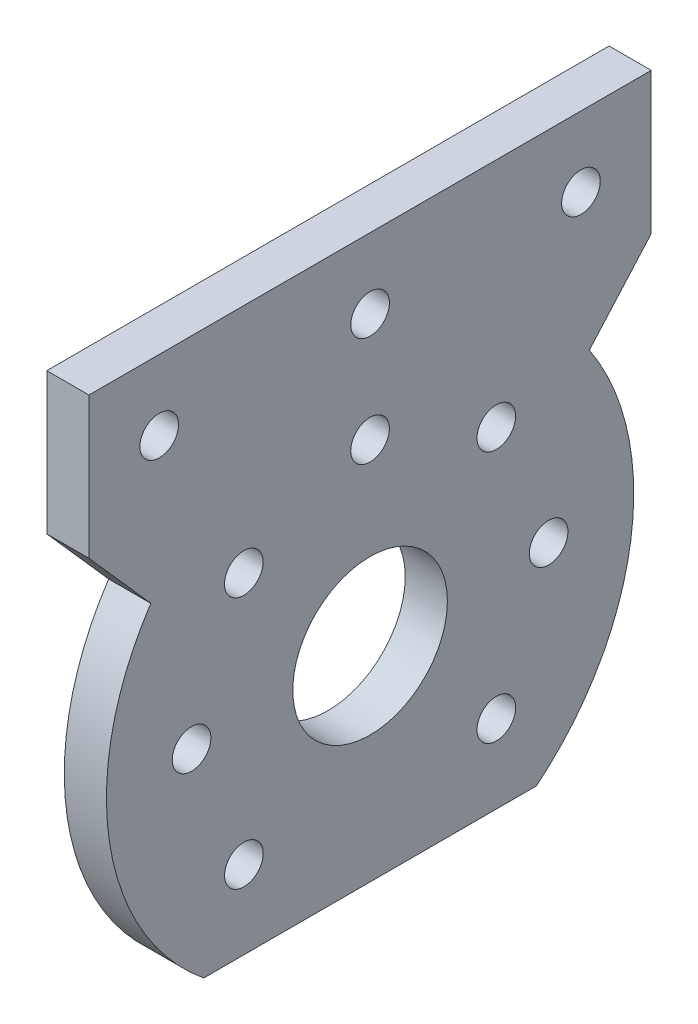
ISO-10303-21;
HEADER;
FILE_DESCRIPTION(('STEP AP214'),'2;1');
FILE_NAME('part.step','',(''),(''),'','','');
FILE_SCHEMA(('AUTOMOTIVE_DESIGN { 1 0 10303 214 1 1 1 1 }'));
ENDSEC;
DATA;
#1=APPLICATION_CONTEXT('core data for automotive mechanical design processes');
#2=APPLICATION_PROTOCOL_DEFINITION('international standard','automotive_design',2000,#1);
#3=PRODUCT_CONTEXT('',#1,'mechanical');
#4=PRODUCT('Part','Part','',(#3));
#5=PRODUCT_RELATED_PRODUCT_CATEGORY('part','',(#4));
#6=PRODUCT_DEFINITION_FORMATION('','',#4);
#7=PRODUCT_DEFINITION_CONTEXT('part definition',#1,'design');
#8=PRODUCT_DEFINITION('design','',#6,#7);
#9=PRODUCT_DEFINITION_SHAPE('','',#8);
#10=(LENGTH_UNIT() NAMED_UNIT(*) SI_UNIT(.MILLI.,.METRE.));
#11=(NAMED_UNIT(*) PLANE_ANGLE_UNIT() SI_UNIT($,.RADIAN.));
#12=(NAMED_UNIT(*) SI_UNIT($,.STERADIAN.) SOLID_ANGLE_UNIT());
#13=UNCERTAINTY_MEASURE_WITH_UNIT(LENGTH_MEASURE(1.E-05),#10,'distance_accuracy_value','');
#14=(GEOMETRIC_REPRESENTATION_CONTEXT(3) GLOBAL_UNCERTAINTY_ASSIGNED_CONTEXT((#13)) GLOBAL_UNIT_ASSIGNED_CONTEXT((#10,
#11,#12)) REPRESENTATION_CONTEXT('',''));
#15=CARTESIAN_POINT('',(0.,0.,0.));
#16=DIRECTION('',(0.,0.,1.));
#17=DIRECTION('',(1.,0.,0.));
#18=AXIS2_PLACEMENT_3D('',#15,#16,#17);
#19=CARTESIAN_POINT('',(6.,0.,0.));
#20=DIRECTION('',(1.,0.,0.));
#21=DIRECTION('',(0.,0.,-1.));
#22=AXIS2_PLACEMENT_3D('',#19,#20,#21);
#23=PLANE('',#22);
#24=CARTESIAN_POINT('',(6.,-25.9195874201447,13.6506110509053));
#25=DIRECTION('',(-1.,0.,0.));
#26=DIRECTION('',(0.,0.,1.));
#27=AXIS2_PLACEMENT_3D('',#24,#25,#26);
#28=CIRCLE('',#27,2.75000000000003);
#29=CARTESIAN_POINT('',(6.,-25.9195874201447,16.4006110509053));
#30=VERTEX_POINT('',#29);
#31=EDGE_CURVE('E166',#30,#30,#28,.T.);
#32=ORIENTED_EDGE('',*,*,#31,.T.);
#33=EDGE_LOOP('',(#32));
#34=FACE_BOUND('',#33,.T.);
#35=CARTESIAN_POINT('',(6.,-43.8778328617474,6.20565310887963));
#36=DIRECTION('',(-1.,0.,0.));
#37=DIRECTION('',(0.,0.,1.));
#38=AXIS2_PLACEMENT_3D('',#35,#36,#37);
#39=CIRCLE('',#38,2.75000000000003);
#40=CARTESIAN_POINT('',(6.,-43.8778328617474,8.95565310887966));
#41=VERTEX_POINT('',#40);
#42=EDGE_CURVE('E196',#41,#41,#39,.T.);
#43=ORIENTED_EDGE('',*,*,#42,.T.);
#44=EDGE_LOOP('',(#43));
#45=FACE_BOUND('',#44,.T.);
#46=CARTESIAN_POINT('',(6.,-43.8668918032364,-29.7153697091477));
#47=DIRECTION('',(-1.,0.,0.));
#48=DIRECTION('',(0.,0.,1.));
#49=AXIS2_PLACEMENT_3D('',#46,#47,#48);
#50=CIRCLE('',#49,2.75000000000003);
#51=CARTESIAN_POINT('',(6.,-43.8668918032364,-26.9653697091477));
#52=VERTEX_POINT('',#51);
#53=EDGE_CURVE('E194',#52,#52,#50,.T.);
#54=ORIENTED_EDGE('',*,*,#53,.T.);
#55=EDGE_LOOP('',(#54));
#56=FACE_BOUND('',#55,.T.);
#57=CARTESIAN_POINT('',(6.,-25.9041144268118,-37.1493865926623));
#58=DIRECTION('',(-1.,0.,0.));
#59=DIRECTION('',(0.,0.,1.));
#60=AXIS2_PLACEMENT_3D('',#57,#58,#59);
#61=CIRCLE('',#60,2.75000000000003);
#62=CARTESIAN_POINT('',(6.,-25.9041144268118,-34.3993865926623));
#63=VERTEX_POINT('',#62);
#64=EDGE_CURVE('E188',#63,#63,#61,.T.);
#65=ORIENTED_EDGE('',*,*,#64,.T.);
#66=EDGE_LOOP('',(#65));
#67=FACE_BOUND('',#66,.T.);
#68=CARTESIAN_POINT('',(6.,-7.94586898520909,-29.7044286506367));
#69=DIRECTION('',(-1.,0.,0.));
#70=DIRECTION('',(0.,0.,1.));
#71=AXIS2_PLACEMENT_3D('',#68,#69,#70);
#72=CIRCLE('',#71,2.75000000000003);
#73=CARTESIAN_POINT('',(6.,-7.94586898520909,-26.9544286506366));
#74=VERTEX_POINT('',#73);
#75=EDGE_CURVE('E176',#74,#74,#72,.T.);
#76=ORIENTED_EDGE('',*,*,#75,.T.);
#77=EDGE_LOOP('',(#76));
#78=FACE_BOUND('',#77,.T.);
#79=CARTESIAN_POINT('',(6.,-0.51185210169441,-11.7416512742121));
#80=DIRECTION('',(-1.,0.,0.));
#81=DIRECTION('',(0.,0.,1.));
#82=AXIS2_PLACEMENT_3D('',#79,#80,#81);
#83=CIRCLE('',#82,2.75000000000003);
#84=CARTESIAN_POINT('',(6.,-0.51185210169441,-8.99165127421204));
#85=VERTEX_POINT('',#84);
#86=EDGE_CURVE('E174',#85,#85,#83,.T.);
#87=ORIENTED_EDGE('',*,*,#86,.T.);
#88=EDGE_LOOP('',(#87));
#89=FACE_BOUND('',#88,.T.);
#90=CARTESIAN_POINT('',(6.,-7.9568100437201,6.21659416739064));
#91=DIRECTION('',(-1.,0.,0.));
#92=DIRECTION('',(0.,0.,1.));
#93=AXIS2_PLACEMENT_3D('',#90,#91,#92);
#94=CIRCLE('',#93,2.75000000000003);
#95=CARTESIAN_POINT('',(6.,-7.9568100437201,8.96659416739067));
#96=VERTEX_POINT('',#95);
#97=EDGE_CURVE('E206',#96,#96,#94,.T.);
#98=ORIENTED_EDGE('',*,*,#97,.T.);
#99=EDGE_LOOP('',(#98));
#100=FACE_BOUND('',#99,.T.);
#101=CARTESIAN_POINT('',(6.,-25.9118509234781,-11.7493877708786));
#102=DIRECTION('',(1.,0.,0.));
#103=DIRECTION('',(0.,0.,-1.));
#104=AXIS2_PLACEMENT_3D('',#101,#102,#103);
#105=CIRCLE('',#104,11.);
#106=CARTESIAN_POINT('',(6.,-25.9118509234781,-22.7493877708786));
#107=VERTEX_POINT('',#106);
#108=EDGE_CURVE('E132',#107,#107,#105,.T.);
#109=ORIENTED_EDGE('',*,*,#108,.F.);
#110=EDGE_LOOP('',(#109));
#111=FACE_BOUND('',#110,.T.);
#112=CARTESIAN_POINT('',(6.,14.9878934624697,-11.7493877708786));
#113=DIRECTION('',(1.,0.,0.));
#114=DIRECTION('',(0.,0.,-1.));
#115=AXIS2_PLACEMENT_3D('',#112,#113,#114);
#116=CIRCLE('',#115,2.75);
#117=CARTESIAN_POINT('',(6.,14.9878934624697,-14.4993877708786));
#118=VERTEX_POINT('',#117);
#119=EDGE_CURVE('E214',#118,#118,#116,.T.);
#120=ORIENTED_EDGE('',*,*,#119,.F.);
#121=EDGE_LOOP('',(#120));
#122=FACE_BOUND('',#121,.T.);
#123=CARTESIAN_POINT('',(6.,14.9878934624697,-41.7493877708786));
#124=DIRECTION('',(1.,0.,0.));
#125=DIRECTION('',(0.,0.,-1.));
#126=AXIS2_PLACEMENT_3D('',#123,#124,#125);
#127=CIRCLE('',#126,2.75);
#128=CARTESIAN_POINT('',(6.,14.9878934624697,-44.4993877708786));
#129=VERTEX_POINT('',#128);
#130=EDGE_CURVE('E228',#129,#129,#127,.T.);
#131=ORIENTED_EDGE('',*,*,#130,.F.);
#132=EDGE_LOOP('',(#131));
#133=FACE_BOUND('',#132,.T.);
#134=CARTESIAN_POINT('',(6.,14.9878934624697,18.2506122291214));
#135=DIRECTION('',(1.,0.,0.));
#136=DIRECTION('',(0.,0.,-1.));
#137=AXIS2_PLACEMENT_3D('',#134,#135,#136);
#138=CIRCLE('',#137,2.75);
#139=CARTESIAN_POINT('',(6.,14.9878934624697,15.5006122291214));
#140=VERTEX_POINT('',#139);
#141=EDGE_CURVE('E212',#140,#140,#138,.T.);
#142=ORIENTED_EDGE('',*,*,#141,.F.);
#143=EDGE_LOOP('',(#142));
#144=FACE_BOUND('',#143,.T.);
#145=DIRECTION('',(0.,-0.749175450531443,0.662371605913938));
#146=VECTOR('',#145,1.);
#147=CARTESIAN_POINT('',(6.,4.8701956870651,-51.7493877708786));
#148=LINE('',#147,#146);
#149=CARTESIAN_POINT('',(6.,4.8701956870651,-51.7493877708786));
#150=VERTEX_POINT('',#149);
#151=CARTESIAN_POINT('',(6.,-5.0878040938187,-42.945180022379));
#152=VERTEX_POINT('',#151);
#153=EDGE_CURVE('E236',#150,#152,#148,.T.);
#154=ORIENTED_EDGE('',*,*,#153,.F.);
#155=DIRECTION('',(0.,1.,0.));
#156=VECTOR('',#155,1.);
#157=CARTESIAN_POINT('',(6.,24.9878934624697,-51.7493877708786));
#158=LINE('',#157,#156);
#159=CARTESIAN_POINT('',(6.,24.9878934624697,-51.7493877708786));
#160=VERTEX_POINT('',#159);
#161=EDGE_CURVE('E154',#150,#160,#158,.T.);
#162=ORIENTED_EDGE('',*,*,#161,.T.);
#163=DIRECTION('',(0.,0.,1.));
#164=VECTOR('',#163,1.);
#165=CARTESIAN_POINT('',(6.,24.9878934624697,28.2506122291214));
#166=LINE('',#165,#164);
#167=CARTESIAN_POINT('',(6.,24.9878934624697,28.2506122291214));
#168=VERTEX_POINT('',#167);
#169=EDGE_CURVE('E137',#160,#168,#166,.T.);
#170=ORIENTED_EDGE('',*,*,#169,.T.);
#171=DIRECTION('',(0.,-1.,0.));
#172=VECTOR('',#171,1.);
#173=CARTESIAN_POINT('',(6.,24.9878934624697,28.2506122291214));
#174=LINE('',#173,#172);
#175=CARTESIAN_POINT('',(6.,4.8701956870651,28.2506122291214));
#176=VERTEX_POINT('',#175);
#177=EDGE_CURVE('E145',#168,#176,#174,.T.);
#178=ORIENTED_EDGE('',*,*,#177,.T.);
#179=DIRECTION('',(0.,0.749175450531444,0.662371605913938));
#180=VECTOR('',#179,1.);
#181=CARTESIAN_POINT('',(6.,-5.0878040938187,19.4464044806217));
#182=LINE('',#181,#180);
#183=CARTESIAN_POINT('',(6.,-5.0878040938187,19.4464044806217));
#184=VERTEX_POINT('',#183);
#185=EDGE_CURVE('E110',#184,#176,#182,.T.);
#186=ORIENTED_EDGE('',*,*,#185,.F.);
#187=CARTESIAN_POINT('',(6.,-25.9118509234781,-11.7493877708786));
#188=DIRECTION('',(-1.,0.,0.));
#189=DIRECTION('',(0.,0.,-1.));
#190=AXIS2_PLACEMENT_3D('',#187,#188,#189);
#191=CIRCLE('',#190,37.5075776418928);
#192=CARTESIAN_POINT('',(6.,-55.0121065375303,11.9147941029882));
#193=VERTEX_POINT('',#192);
#194=EDGE_CURVE('E237',#193,#184,#191,.T.);
#195=ORIENTED_EDGE('',*,*,#194,.F.);
#196=DIRECTION('',(0.,0.,-1.));
#197=VECTOR('',#196,1.);
#198=CARTESIAN_POINT('',(6.,-55.0121065375303,28.2506122291214));
#199=LINE('',#198,#197);
#200=CARTESIAN_POINT('',(6.,-55.0121065375303,-35.4135696447454));
#201=VERTEX_POINT('',#200);
#202=EDGE_CURVE('E234',#193,#201,#199,.T.);
#203=ORIENTED_EDGE('',*,*,#202,.T.);
#204=EDGE_CURVE('E239',#152,#201,#191,.T.);
#205=ORIENTED_EDGE('',*,*,#204,.F.);
#206=EDGE_LOOP('',(#154,#162,#170,#178,#186,#195,#203,#205));
#207=FACE_BOUND('',#206,.T.);
#208=ADVANCED_FACE('F39',(#34,#45,#56,#67,#78,#89,#100,#111,#122,#133,#144,#207),#23,.T.);
#209=CARTESIAN_POINT('',(0.,0.,0.));
#210=DIRECTION('',(1.,0.,0.));
#211=DIRECTION('',(0.,0.,-1.));
#212=AXIS2_PLACEMENT_3D('',#209,#210,#211);
#213=PLANE('',#212);
#214=CARTESIAN_POINT('',(0.,-25.9195874201447,13.6506110509053));
#215=DIRECTION('',(-1.,0.,0.));
#216=DIRECTION('',(0.,0.,1.));
#217=AXIS2_PLACEMENT_3D('',#214,#215,#216);
#218=CIRCLE('',#217,2.75000000000003);
#219=CARTESIAN_POINT('',(0.,-25.9195874201447,16.4006110509053));
#220=VERTEX_POINT('',#219);
#221=EDGE_CURVE('E203',#220,#220,#218,.T.);
#222=ORIENTED_EDGE('',*,*,#221,.F.);
#223=EDGE_LOOP('',(#222));
#224=FACE_BOUND('',#223,.T.);
#225=CARTESIAN_POINT('',(0.,-43.8778328617474,6.20565310887963));
#226=DIRECTION('',(-1.,0.,0.));
#227=DIRECTION('',(0.,0.,1.));
#228=AXIS2_PLACEMENT_3D('',#225,#226,#227);
#229=CIRCLE('',#228,2.75000000000003);
#230=CARTESIAN_POINT('',(0.,-43.8778328617474,8.95565310887966));
#231=VERTEX_POINT('',#230);
#232=EDGE_CURVE('E191',#231,#231,#229,.T.);
#233=ORIENTED_EDGE('',*,*,#232,.F.);
#234=EDGE_LOOP('',(#233));
#235=FACE_BOUND('',#234,.T.);
#236=CARTESIAN_POINT('',(0.,-43.8668918032364,-29.7153697091477));
#237=DIRECTION('',(-1.,0.,0.));
#238=DIRECTION('',(0.,0.,1.));
#239=AXIS2_PLACEMENT_3D('',#236,#237,#238);
#240=CIRCLE('',#239,2.75000000000003);
#241=CARTESIAN_POINT('',(0.,-43.8668918032364,-26.9653697091477));
#242=VERTEX_POINT('',#241);
#243=EDGE_CURVE('E189',#242,#242,#240,.T.);
#244=ORIENTED_EDGE('',*,*,#243,.F.);
#245=EDGE_LOOP('',(#244));
#246=FACE_BOUND('',#245,.T.);
#247=CARTESIAN_POINT('',(0.,-25.9041144268118,-37.1493865926623));
#248=DIRECTION('',(-1.,0.,0.));
#249=DIRECTION('',(0.,0.,1.));
#250=AXIS2_PLACEMENT_3D('',#247,#248,#249);
#251=CIRCLE('',#250,2.75000000000003);
#252=CARTESIAN_POINT('',(0.,-25.9041144268118,-34.3993865926623));
#253=VERTEX_POINT('',#252);
#254=EDGE_CURVE('E181',#253,#253,#251,.T.);
#255=ORIENTED_EDGE('',*,*,#254,.F.);
#256=EDGE_LOOP('',(#255));
#257=FACE_BOUND('',#256,.T.);
#258=CARTESIAN_POINT('',(0.,-7.94586898520909,-29.7044286506367));
#259=DIRECTION('',(-1.,0.,0.));
#260=DIRECTION('',(0.,0.,1.));
#261=AXIS2_PLACEMENT_3D('',#258,#259,#260);
#262=CIRCLE('',#261,2.75000000000003);
#263=CARTESIAN_POINT('',(0.,-7.94586898520909,-26.9544286506366));
#264=VERTEX_POINT('',#263);
#265=EDGE_CURVE('E179',#264,#264,#262,.T.);
#266=ORIENTED_EDGE('',*,*,#265,.F.);
#267=EDGE_LOOP('',(#266));
#268=FACE_BOUND('',#267,.T.);
#269=CARTESIAN_POINT('',(0.,-0.51185210169441,-11.7416512742121));
#270=DIRECTION('',(-1.,0.,0.));
#271=DIRECTION('',(0.,0.,1.));
#272=AXIS2_PLACEMENT_3D('',#269,#270,#271);
#273=CIRCLE('',#272,2.75000000000003);
#274=CARTESIAN_POINT('',(0.,-0.51185210169441,-8.99165127421204));
#275=VERTEX_POINT('',#274);
#276=EDGE_CURVE('E168',#275,#275,#273,.T.);
#277=ORIENTED_EDGE('',*,*,#276,.F.);
#278=EDGE_LOOP('',(#277));
#279=FACE_BOUND('',#278,.T.);
#280=CARTESIAN_POINT('',(0.,-7.9568100437201,6.21659416739064));
#281=DIRECTION('',(-1.,0.,0.));
#282=DIRECTION('',(0.,0.,1.));
#283=AXIS2_PLACEMENT_3D('',#280,#281,#282);
#284=CIRCLE('',#283,2.75000000000003);
#285=CARTESIAN_POINT('',(0.,-7.9568100437201,8.96659416739067));
#286=VERTEX_POINT('',#285);
#287=EDGE_CURVE('E171',#286,#286,#284,.T.);
#288=ORIENTED_EDGE('',*,*,#287,.F.);
#289=EDGE_LOOP('',(#288));
#290=FACE_BOUND('',#289,.T.);
#291=CARTESIAN_POINT('',(0.,-25.9118509234781,-11.7493877708786));
#292=DIRECTION('',(1.,0.,0.));
#293=DIRECTION('',(0.,0.,-1.));
#294=AXIS2_PLACEMENT_3D('',#291,#292,#293);
#295=CIRCLE('',#294,11.);
#296=CARTESIAN_POINT('',(0.,-25.9118509234781,-22.7493877708786));
#297=VERTEX_POINT('',#296);
#298=EDGE_CURVE('E129',#297,#297,#295,.T.);
#299=ORIENTED_EDGE('',*,*,#298,.T.);
#300=EDGE_LOOP('',(#299));
#301=FACE_BOUND('',#300,.T.);
#302=CARTESIAN_POINT('',(0.,14.9878934624697,-11.7493877708786));
#303=DIRECTION('',(1.,0.,0.));
#304=DIRECTION('',(0.,0.,-1.));
#305=AXIS2_PLACEMENT_3D('',#302,#303,#304);
#306=CIRCLE('',#305,2.75);
#307=CARTESIAN_POINT('',(0.,14.9878934624697,-14.4993877708786));
#308=VERTEX_POINT('',#307);
#309=EDGE_CURVE('E207',#308,#308,#306,.T.);
#310=ORIENTED_EDGE('',*,*,#309,.T.);
#311=EDGE_LOOP('',(#310));
#312=FACE_BOUND('',#311,.T.);
#313=CARTESIAN_POINT('',(0.,14.9878934624697,-41.7493877708786));
#314=DIRECTION('',(1.,0.,0.));
#315=DIRECTION('',(0.,0.,-1.));
#316=AXIS2_PLACEMENT_3D('',#313,#314,#315);
#317=CIRCLE('',#316,2.75);
#318=CARTESIAN_POINT('',(0.,14.9878934624697,-44.4993877708786));
#319=VERTEX_POINT('',#318);
#320=EDGE_CURVE('E217',#319,#319,#317,.T.);
#321=ORIENTED_EDGE('',*,*,#320,.T.);
#322=EDGE_LOOP('',(#321));
#323=FACE_BOUND('',#322,.T.);
#324=CARTESIAN_POINT('',(0.,14.9878934624697,18.2506122291214));
#325=DIRECTION('',(1.,0.,0.));
#326=DIRECTION('',(0.,0.,-1.));
#327=AXIS2_PLACEMENT_3D('',#324,#325,#326);
#328=CIRCLE('',#327,2.75);
#329=CARTESIAN_POINT('',(0.,14.9878934624697,15.5006122291214));
#330=VERTEX_POINT('',#329);
#331=EDGE_CURVE('E224',#330,#330,#328,.T.);
#332=ORIENTED_EDGE('',*,*,#331,.T.);
#333=EDGE_LOOP('',(#332));
#334=FACE_BOUND('',#333,.T.);
#335=DIRECTION('',(0.,1.,0.));
#336=VECTOR('',#335,1.);
#337=CARTESIAN_POINT('',(0.,24.9878934624697,-51.7493877708786));
#338=LINE('',#337,#336);
#339=CARTESIAN_POINT('',(0.,4.8701956870651,-51.7493877708786));
#340=VERTEX_POINT('',#339);
#341=CARTESIAN_POINT('',(0.,24.9878934624697,-51.7493877708786));
#342=VERTEX_POINT('',#341);
#343=EDGE_CURVE('E135',#340,#342,#338,.T.);
#344=ORIENTED_EDGE('',*,*,#343,.F.);
#345=DIRECTION('',(0.,-0.749175450531443,0.662371605913938));
#346=VECTOR('',#345,1.);
#347=CARTESIAN_POINT('',(0.,4.8701956870651,-51.7493877708786));
#348=LINE('',#347,#346);
#349=CARTESIAN_POINT('',(0.,-5.0878040938187,-42.945180022379));
#350=VERTEX_POINT('',#349);
#351=EDGE_CURVE('E124',#340,#350,#348,.T.);
#352=ORIENTED_EDGE('',*,*,#351,.T.);
#353=CARTESIAN_POINT('',(0.,-25.9118509234781,-11.7493877708786));
#354=DIRECTION('',(-1.,0.,0.));
#355=DIRECTION('',(0.,0.,-1.));
#356=AXIS2_PLACEMENT_3D('',#353,#354,#355);
#357=CIRCLE('',#356,37.5075776418928);
#358=CARTESIAN_POINT('',(0.,-55.0121065375303,-35.4135696447454));
#359=VERTEX_POINT('',#358);
#360=EDGE_CURVE('E122',#350,#359,#357,.T.);
#361=ORIENTED_EDGE('',*,*,#360,.T.);
#362=DIRECTION('',(0.,0.,-1.));
#363=VECTOR('',#362,1.);
#364=CARTESIAN_POINT('',(0.,-55.0121065375303,28.2506122291214));
#365=LINE('',#364,#363);
#366=CARTESIAN_POINT('',(0.,-55.0121065375303,11.9147941029882));
#367=VERTEX_POINT('',#366);
#368=EDGE_CURVE('E126',#367,#359,#365,.T.);
#369=ORIENTED_EDGE('',*,*,#368,.F.);
#370=CARTESIAN_POINT('',(0.,-25.9118509234781,-11.7493877708786));
#371=DIRECTION('',(1.,0.,0.));
#372=DIRECTION('',(0.,0.,-1.));
#373=AXIS2_PLACEMENT_3D('',#370,#371,#372);
#374=CIRCLE('',#373,37.5075776418928);
#375=CARTESIAN_POINT('',(0.,-5.08780409381871,19.4464044806217));
#376=VERTEX_POINT('',#375);
#377=EDGE_CURVE('E11',#367,#376,#374,.F.);
#378=ORIENTED_EDGE('',*,*,#377,.T.);
#379=DIRECTION('',(0.,0.749175450531444,0.662371605913938));
#380=VECTOR('',#379,1.);
#381=CARTESIAN_POINT('',(0.,-5.0878040938187,19.4464044806217));
#382=LINE('',#381,#380);
#383=CARTESIAN_POINT('',(0.,4.8701956870651,28.2506122291214));
#384=VERTEX_POINT('',#383);
#385=EDGE_CURVE('E53',#376,#384,#382,.T.);
#386=ORIENTED_EDGE('',*,*,#385,.T.);
#387=DIRECTION('',(0.,-1.,0.));
#388=VECTOR('',#387,1.);
#389=CARTESIAN_POINT('',(0.,24.9878934624697,28.2506122291214));
#390=LINE('',#389,#388);
#391=CARTESIAN_POINT('',(0.,24.9878934624697,28.2506122291214));
#392=VERTEX_POINT('',#391);
#393=EDGE_CURVE('E117',#392,#384,#390,.T.);
#394=ORIENTED_EDGE('',*,*,#393,.F.);
#395=DIRECTION('',(0.,0.,1.));
#396=VECTOR('',#395,1.);
#397=CARTESIAN_POINT('',(0.,24.9878934624697,28.2506122291214));
#398=LINE('',#397,#396);
#399=EDGE_CURVE('E142',#342,#392,#398,.T.);
#400=ORIENTED_EDGE('',*,*,#399,.F.);
#401=EDGE_LOOP('',(#344,#352,#361,#369,#378,#386,#394,#400));
#402=FACE_BOUND('',#401,.T.);
#403=ADVANCED_FACE('F116',(#224,#235,#246,#257,#268,#279,#290,#301,#312,#323,#334,#402),#213,.F.);
#404=CARTESIAN_POINT('',(6.,24.9878934624697,28.2506122291214));
#405=DIRECTION('',(0.,0.,-1.));
#406=DIRECTION('',(0.,1.,0.));
#407=AXIS2_PLACEMENT_3D('',#404,#405,#406);
#408=PLANE('',#407);
#409=ORIENTED_EDGE('',*,*,#393,.T.);
#410=DIRECTION('',(1.,0.,0.));
#411=VECTOR('',#410,1.);
#412=CARTESIAN_POINT('',(0.,4.8701956870651,28.2506122291214));
#413=LINE('',#412,#411);
#414=EDGE_CURVE('E102',#384,#176,#413,.T.);
#415=ORIENTED_EDGE('',*,*,#414,.T.);
#416=ORIENTED_EDGE('',*,*,#177,.F.);
#417=DIRECTION('',(-1.,0.,0.));
#418=VECTOR('',#417,1.);
#419=CARTESIAN_POINT('',(6.,24.9878934624697,28.2506122291214));
#420=LINE('',#419,#418);
#421=EDGE_CURVE('E130',#168,#392,#420,.T.);
#422=ORIENTED_EDGE('',*,*,#421,.T.);
#423=EDGE_LOOP('',(#409,#415,#416,#422));
#424=FACE_BOUND('',#423,.T.);
#425=ADVANCED_FACE('F41',(#424),#408,.F.);
#426=CARTESIAN_POINT('',(6.,-55.0121065375303,28.2506122291214));
#427=DIRECTION('',(0.,1.,0.));
#428=DIRECTION('',(0.,0.,1.));
#429=AXIS2_PLACEMENT_3D('',#426,#427,#428);
#430=PLANE('',#429);
#431=ORIENTED_EDGE('',*,*,#202,.F.);
#432=DIRECTION('',(1.,0.,0.));
#433=VECTOR('',#432,1.);
#434=CARTESIAN_POINT('',(0.,-55.0121065375303,11.9147941029882));
#435=LINE('',#434,#433);
#436=EDGE_CURVE('E167',#193,#367,#435,.F.);
#437=ORIENTED_EDGE('',*,*,#436,.T.);
#438=ORIENTED_EDGE('',*,*,#368,.T.);
#439=DIRECTION('',(1.,0.,0.));
#440=VECTOR('',#439,1.);
#441=CARTESIAN_POINT('',(0.,-55.0121065375303,-35.4135696447454));
#442=LINE('',#441,#440);
#443=EDGE_CURVE('E65',#359,#201,#442,.T.);
#444=ORIENTED_EDGE('',*,*,#443,.T.);
#445=EDGE_LOOP('',(#431,#437,#438,#444));
#446=FACE_BOUND('',#445,.T.);
#447=ADVANCED_FACE('F242',(#446),#430,.F.);
#448=CARTESIAN_POINT('',(6.,24.9878934624697,-51.7493877708786));
#449=DIRECTION('',(0.,0.,1.));
#450=DIRECTION('',(1.,0.,0.));
#451=AXIS2_PLACEMENT_3D('',#448,#449,#450);
#452=PLANE('',#451);
#453=ORIENTED_EDGE('',*,*,#161,.F.);
#454=DIRECTION('',(1.,0.,0.));
#455=VECTOR('',#454,1.);
#456=CARTESIAN_POINT('',(0.,4.8701956870651,-51.7493877708786));
#457=LINE('',#456,#455);
#458=EDGE_CURVE('E115',#340,#150,#457,.T.);
#459=ORIENTED_EDGE('',*,*,#458,.F.);
#460=ORIENTED_EDGE('',*,*,#343,.T.);
#461=DIRECTION('',(-1.,0.,0.));
#462=VECTOR('',#461,1.);
#463=CARTESIAN_POINT('',(6.,24.9878934624697,-51.7493877708786));
#464=LINE('',#463,#462);
#465=EDGE_CURVE('E50',#160,#342,#464,.T.);
#466=ORIENTED_EDGE('',*,*,#465,.F.);
#467=EDGE_LOOP('',(#453,#459,#460,#466));
#468=FACE_BOUND('',#467,.T.);
#469=ADVANCED_FACE('F152',(#468),#452,.F.);
#470=CARTESIAN_POINT('',(6.,24.9878934624697,28.2506122291214));
#471=DIRECTION('',(0.,-1.,0.));
#472=DIRECTION('',(0.,0.,-1.));
#473=AXIS2_PLACEMENT_3D('',#470,#471,#472);
#474=PLANE('',#473);
#475=ORIENTED_EDGE('',*,*,#399,.T.);
#476=ORIENTED_EDGE('',*,*,#421,.F.);
#477=ORIENTED_EDGE('',*,*,#169,.F.);
#478=ORIENTED_EDGE('',*,*,#465,.T.);
#479=EDGE_LOOP('',(#475,#476,#477,#478));
#480=FACE_BOUND('',#479,.T.);
#481=ADVANCED_FACE('F149',(#480),#474,.F.);
#482=CARTESIAN_POINT('',(0.,14.9878934624697,18.2506122291214));
#483=DIRECTION('',(1.,0.,0.));
#484=DIRECTION('',(0.,0.,-1.));
#485=AXIS2_PLACEMENT_3D('',#482,#483,#484);
#486=CYLINDRICAL_SURFACE('',#485,2.75);
#487=ORIENTED_EDGE('',*,*,#331,.F.);
#488=EDGE_LOOP('',(#487));
#489=FACE_BOUND('',#488,.T.);
#490=ORIENTED_EDGE('',*,*,#141,.T.);
#491=EDGE_LOOP('',(#490));
#492=FACE_BOUND('',#491,.T.);
#493=ADVANCED_FACE('F276',(#489,#492),#486,.F.);
#494=CARTESIAN_POINT('',(0.,14.9878934624697,-41.7493877708786));
#495=DIRECTION('',(1.,0.,0.));
#496=DIRECTION('',(0.,0.,-1.));
#497=AXIS2_PLACEMENT_3D('',#494,#495,#496);
#498=CYLINDRICAL_SURFACE('',#497,2.75);
#499=ORIENTED_EDGE('',*,*,#320,.F.);
#500=EDGE_LOOP('',(#499));
#501=FACE_BOUND('',#500,.T.);
#502=ORIENTED_EDGE('',*,*,#130,.T.);
#503=EDGE_LOOP('',(#502));
#504=FACE_BOUND('',#503,.T.);
#505=ADVANCED_FACE('F273',(#501,#504),#498,.F.);
#506=CARTESIAN_POINT('',(0.,14.9878934624697,-11.7493877708786));
#507=DIRECTION('',(1.,0.,0.));
#508=DIRECTION('',(0.,0.,-1.));
#509=AXIS2_PLACEMENT_3D('',#506,#507,#508);
#510=CYLINDRICAL_SURFACE('',#509,2.75);
#511=ORIENTED_EDGE('',*,*,#309,.F.);
#512=EDGE_LOOP('',(#511));
#513=FACE_BOUND('',#512,.T.);
#514=ORIENTED_EDGE('',*,*,#119,.T.);
#515=EDGE_LOOP('',(#514));
#516=FACE_BOUND('',#515,.T.);
#517=ADVANCED_FACE('F392',(#513,#516),#510,.F.);
#518=CARTESIAN_POINT('',(0.,-25.9118509234781,-11.7493877708786));
#519=DIRECTION('',(1.,0.,0.));
#520=DIRECTION('',(0.,0.,-1.));
#521=AXIS2_PLACEMENT_3D('',#518,#519,#520);
#522=CYLINDRICAL_SURFACE('',#521,11.);
#523=ORIENTED_EDGE('',*,*,#298,.F.);
#524=EDGE_LOOP('',(#523));
#525=FACE_BOUND('',#524,.T.);
#526=ORIENTED_EDGE('',*,*,#108,.T.);
#527=EDGE_LOOP('',(#526));
#528=FACE_BOUND('',#527,.T.);
#529=ADVANCED_FACE('F384',(#525,#528),#522,.F.);
#530=CARTESIAN_POINT('',(6.,-7.9568100437201,6.21659416739064));
#531=DIRECTION('',(-1.,0.,0.));
#532=DIRECTION('',(0.,0.,1.));
#533=AXIS2_PLACEMENT_3D('',#530,#531,#532);
#534=CYLINDRICAL_SURFACE('',#533,2.75000000000003);
#535=ORIENTED_EDGE('',*,*,#97,.F.);
#536=EDGE_LOOP('',(#535));
#537=FACE_BOUND('',#536,.T.);
#538=ORIENTED_EDGE('',*,*,#287,.T.);
#539=EDGE_LOOP('',(#538));
#540=FACE_BOUND('',#539,.T.);
#541=ADVANCED_FACE('F376',(#537,#540),#534,.F.);
#542=CARTESIAN_POINT('',(6.,-0.51185210169441,-11.7416512742121));
#543=DIRECTION('',(-1.,0.,0.));
#544=DIRECTION('',(0.,0.,1.));
#545=AXIS2_PLACEMENT_3D('',#542,#543,#544);
#546=CYLINDRICAL_SURFACE('',#545,2.75000000000003);
#547=ORIENTED_EDGE('',*,*,#86,.F.);
#548=EDGE_LOOP('',(#547));
#549=FACE_BOUND('',#548,.T.);
#550=ORIENTED_EDGE('',*,*,#276,.T.);
#551=EDGE_LOOP('',(#550));
#552=FACE_BOUND('',#551,.T.);
#553=ADVANCED_FACE('F368',(#549,#552),#546,.F.);
#554=CARTESIAN_POINT('',(6.,-7.94586898520909,-29.7044286506367));
#555=DIRECTION('',(-1.,0.,0.));
#556=DIRECTION('',(0.,0.,1.));
#557=AXIS2_PLACEMENT_3D('',#554,#555,#556);
#558=CYLINDRICAL_SURFACE('',#557,2.75000000000003);
#559=ORIENTED_EDGE('',*,*,#75,.F.);
#560=EDGE_LOOP('',(#559));
#561=FACE_BOUND('',#560,.T.);
#562=ORIENTED_EDGE('',*,*,#265,.T.);
#563=EDGE_LOOP('',(#562));
#564=FACE_BOUND('',#563,.T.);
#565=ADVANCED_FACE('F358',(#561,#564),#558,.F.);
#566=CARTESIAN_POINT('',(6.,-25.9041144268118,-37.1493865926623));
#567=DIRECTION('',(-1.,0.,0.));
#568=DIRECTION('',(0.,0.,1.));
#569=AXIS2_PLACEMENT_3D('',#566,#567,#568);
#570=CYLINDRICAL_SURFACE('',#569,2.75000000000003);
#571=ORIENTED_EDGE('',*,*,#64,.F.);
#572=EDGE_LOOP('',(#571));
#573=FACE_BOUND('',#572,.T.);
#574=ORIENTED_EDGE('',*,*,#254,.T.);
#575=EDGE_LOOP('',(#574));
#576=FACE_BOUND('',#575,.T.);
#577=ADVANCED_FACE('F347',(#573,#576),#570,.F.);
#578=CARTESIAN_POINT('',(6.,-43.8668918032364,-29.7153697091477));
#579=DIRECTION('',(-1.,0.,0.));
#580=DIRECTION('',(0.,0.,1.));
#581=AXIS2_PLACEMENT_3D('',#578,#579,#580);
#582=CYLINDRICAL_SURFACE('',#581,2.75000000000003);
#583=ORIENTED_EDGE('',*,*,#53,.F.);
#584=EDGE_LOOP('',(#583));
#585=FACE_BOUND('',#584,.T.);
#586=ORIENTED_EDGE('',*,*,#243,.T.);
#587=EDGE_LOOP('',(#586));
#588=FACE_BOUND('',#587,.T.);
#589=ADVANCED_FACE('F338',(#585,#588),#582,.F.);
#590=CARTESIAN_POINT('',(6.,-43.8778328617474,6.20565310887963));
#591=DIRECTION('',(-1.,0.,0.));
#592=DIRECTION('',(0.,0.,1.));
#593=AXIS2_PLACEMENT_3D('',#590,#591,#592);
#594=CYLINDRICAL_SURFACE('',#593,2.75000000000003);
#595=ORIENTED_EDGE('',*,*,#42,.F.);
#596=EDGE_LOOP('',(#595));
#597=FACE_BOUND('',#596,.T.);
#598=ORIENTED_EDGE('',*,*,#232,.T.);
#599=EDGE_LOOP('',(#598));
#600=FACE_BOUND('',#599,.T.);
#601=ADVANCED_FACE('F256',(#597,#600),#594,.F.);
#602=CARTESIAN_POINT('',(6.,-25.9195874201447,13.6506110509053));
#603=DIRECTION('',(-1.,0.,0.));
#604=DIRECTION('',(0.,0.,1.));
#605=AXIS2_PLACEMENT_3D('',#602,#603,#604);
#606=CYLINDRICAL_SURFACE('',#605,2.75000000000003);
#607=ORIENTED_EDGE('',*,*,#31,.F.);
#608=EDGE_LOOP('',(#607));
#609=FACE_BOUND('',#608,.T.);
#610=ORIENTED_EDGE('',*,*,#221,.T.);
#611=EDGE_LOOP('',(#610));
#612=FACE_BOUND('',#611,.T.);
#613=ADVANCED_FACE('F250',(#609,#612),#606,.F.);
#614=CARTESIAN_POINT('',(0.,-25.9118509234781,-11.7493877708786));
#615=DIRECTION('',(1.,0.,0.));
#616=DIRECTION('',(0.,0.,-1.));
#617=AXIS2_PLACEMENT_3D('',#614,#615,#616);
#618=CYLINDRICAL_SURFACE('',#617,37.5075776418928);
#619=ORIENTED_EDGE('',*,*,#194,.T.);
#620=DIRECTION('',(1.,0.,0.));
#621=VECTOR('',#620,1.);
#622=CARTESIAN_POINT('',(0.,-5.0878040938187,19.4464044806217));
#623=LINE('',#622,#621);
#624=EDGE_CURVE('E114',#376,#184,#623,.T.);
#625=ORIENTED_EDGE('',*,*,#624,.F.);
#626=ORIENTED_EDGE('',*,*,#377,.F.);
#627=ORIENTED_EDGE('',*,*,#436,.F.);
#628=EDGE_LOOP('',(#619,#625,#626,#627));
#629=FACE_BOUND('',#628,.T.);
#630=ADVANCED_FACE('F249',(#629),#618,.T.);
#631=CARTESIAN_POINT('',(0.,-5.0878040938187,19.4464044806217));
#632=DIRECTION('',(0.,0.662371605913938,-0.749175450531443));
#633=DIRECTION('',(0.,0.749175450531444,0.662371605913938));
#634=AXIS2_PLACEMENT_3D('',#631,#632,#633);
#635=PLANE('',#634);
#636=ORIENTED_EDGE('',*,*,#185,.T.);
#637=ORIENTED_EDGE('',*,*,#414,.F.);
#638=ORIENTED_EDGE('',*,*,#385,.F.);
#639=ORIENTED_EDGE('',*,*,#624,.T.);
#640=EDGE_LOOP('',(#636,#637,#638,#639));
#641=FACE_BOUND('',#640,.T.);
#642=ADVANCED_FACE('F104',(#641),#635,.F.);
#643=ORIENTED_EDGE('',*,*,#360,.F.);
#644=DIRECTION('',(1.,0.,0.));
#645=VECTOR('',#644,1.);
#646=CARTESIAN_POINT('',(0.,-5.0878040938187,-42.945180022379));
#647=LINE('',#646,#645);
#648=EDGE_CURVE('E157',#350,#152,#647,.T.);
#649=ORIENTED_EDGE('',*,*,#648,.T.);
#650=ORIENTED_EDGE('',*,*,#204,.T.);
#651=ORIENTED_EDGE('',*,*,#443,.F.);
#652=EDGE_LOOP('',(#643,#649,#650,#651));
#653=FACE_BOUND('',#652,.T.);
#654=ADVANCED_FACE('F253',(#653),#618,.T.);
#655=CARTESIAN_POINT('',(0.,4.8701956870651,-51.7493877708786));
#656=DIRECTION('',(0.,0.662371605913938,0.749175450531443));
#657=DIRECTION('',(0.,-0.749175450531443,0.662371605913938));
#658=AXIS2_PLACEMENT_3D('',#655,#656,#657);
#659=PLANE('',#658);
#660=ORIENTED_EDGE('',*,*,#153,.T.);
#661=ORIENTED_EDGE('',*,*,#648,.F.);
#662=ORIENTED_EDGE('',*,*,#351,.F.);
#663=ORIENTED_EDGE('',*,*,#458,.T.);
#664=EDGE_LOOP('',(#660,#661,#662,#663));
#665=FACE_BOUND('',#664,.T.);
#666=ADVANCED_FACE('F263',(#665),#659,.F.);
#667=CLOSED_SHELL('',(#208,#403,#425,#447,#469,#481,#493,#505,#517,#529,#541,#553,#565,#577,
#589,#601,#613,#630,#642,#654,#666));
#668=MANIFOLD_SOLID_BREP('B2',#667);
#669=ADVANCED_BREP_SHAPE_REPRESENTATION('',(#18,#668),#14);
#670=SHAPE_DEFINITION_REPRESENTATION(#9,#669);
ENDSEC;
END-ISO-10303-21;
